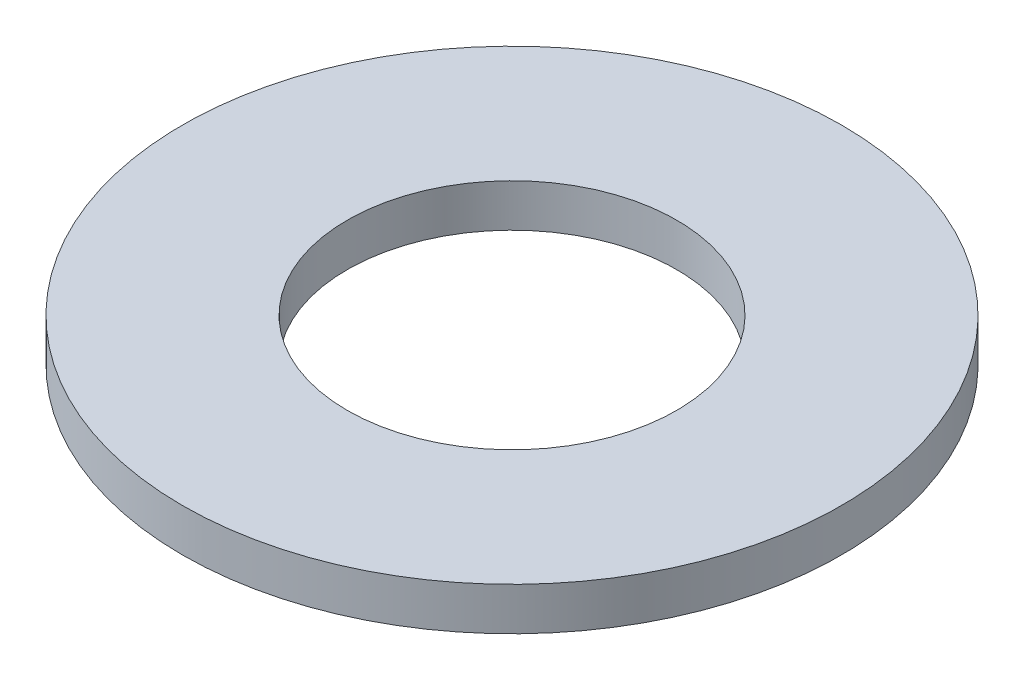
ISO-10303-21;
HEADER;
FILE_DESCRIPTION(('STEP AP214'),'2;1');
FILE_NAME('part.step','',(''),(''),'','','');
FILE_SCHEMA(('AUTOMOTIVE_DESIGN { 1 0 10303 214 1 1 1 1 }'));
ENDSEC;
DATA;
#1=APPLICATION_CONTEXT('core data for automotive mechanical design processes');
#2=APPLICATION_PROTOCOL_DEFINITION('international standard','automotive_design',2000,#1);
#3=PRODUCT_CONTEXT('',#1,'mechanical');
#4=PRODUCT('Part','Part','',(#3));
#5=PRODUCT_RELATED_PRODUCT_CATEGORY('part','',(#4));
#6=PRODUCT_DEFINITION_FORMATION('','',#4);
#7=PRODUCT_DEFINITION_CONTEXT('part definition',#1,'design');
#8=PRODUCT_DEFINITION('design','',#6,#7);
#9=PRODUCT_DEFINITION_SHAPE('','',#8);
#10=(LENGTH_UNIT() NAMED_UNIT(*) SI_UNIT(.MILLI.,.METRE.));
#11=(NAMED_UNIT(*) PLANE_ANGLE_UNIT() SI_UNIT($,.RADIAN.));
#12=(NAMED_UNIT(*) SI_UNIT($,.STERADIAN.) SOLID_ANGLE_UNIT());
#13=UNCERTAINTY_MEASURE_WITH_UNIT(LENGTH_MEASURE(1.E-05),#10,'distance_accuracy_value','');
#14=(GEOMETRIC_REPRESENTATION_CONTEXT(3) GLOBAL_UNCERTAINTY_ASSIGNED_CONTEXT((#13)) GLOBAL_UNIT_ASSIGNED_CONTEXT((#10,
#11,#12)) REPRESENTATION_CONTEXT('',''));
#15=CARTESIAN_POINT('',(0.,0.,0.));
#16=DIRECTION('',(0.,0.,1.));
#17=DIRECTION('',(1.,0.,0.));
#18=AXIS2_PLACEMENT_3D('',#15,#16,#17);
#19=CARTESIAN_POINT('',(0.,1.651,0.));
#20=DIRECTION('',(0.,1.,0.));
#21=DIRECTION('',(0.,0.,1.));
#22=AXIS2_PLACEMENT_3D('',#19,#20,#21);
#23=PLANE('',#22);
#24=CARTESIAN_POINT('',(0.,1.651,0.));
#25=DIRECTION('',(0.,1.,0.));
#26=DIRECTION('',(0.,0.,1.));
#27=AXIS2_PLACEMENT_3D('',#24,#25,#26);
#28=CIRCLE('',#27,12.7);
#29=CARTESIAN_POINT('',(0.,1.651,12.7));
#30=VERTEX_POINT('',#29);
#31=EDGE_CURVE('E10',#30,#30,#28,.T.);
#32=ORIENTED_EDGE('',*,*,#31,.T.);
#33=EDGE_LOOP('',(#32));
#34=FACE_BOUND('',#33,.T.);
#35=CARTESIAN_POINT('',(0.,1.651,0.));
#36=DIRECTION('',(0.,1.,0.));
#37=DIRECTION('',(0.,0.,1.));
#38=AXIS2_PLACEMENT_3D('',#35,#36,#37);
#39=CIRCLE('',#38,6.35);
#40=CARTESIAN_POINT('',(0.,1.651,6.35));
#41=VERTEX_POINT('',#40);
#42=EDGE_CURVE('E50',#41,#41,#39,.T.);
#43=ORIENTED_EDGE('',*,*,#42,.F.);
#44=EDGE_LOOP('',(#43));
#45=FACE_BOUND('',#44,.T.);
#46=ADVANCED_FACE('F39',(#34,#45),#23,.T.);
#47=CARTESIAN_POINT('',(0.,0.,0.));
#48=DIRECTION('',(0.,1.,0.));
#49=DIRECTION('',(0.,0.,1.));
#50=AXIS2_PLACEMENT_3D('',#47,#48,#49);
#51=PLANE('',#50);
#52=CARTESIAN_POINT('',(0.,0.,0.));
#53=DIRECTION('',(0.,1.,0.));
#54=DIRECTION('',(0.,0.,1.));
#55=AXIS2_PLACEMENT_3D('',#52,#53,#54);
#56=CIRCLE('',#55,12.7);
#57=CARTESIAN_POINT('',(0.,0.,12.7));
#58=VERTEX_POINT('',#57);
#59=EDGE_CURVE('E43',#58,#58,#56,.T.);
#60=ORIENTED_EDGE('',*,*,#59,.F.);
#61=EDGE_LOOP('',(#60));
#62=FACE_BOUND('',#61,.T.);
#63=CARTESIAN_POINT('',(0.,0.,0.));
#64=DIRECTION('',(0.,1.,0.));
#65=DIRECTION('',(0.,0.,1.));
#66=AXIS2_PLACEMENT_3D('',#63,#64,#65);
#67=CIRCLE('',#66,6.35);
#68=CARTESIAN_POINT('',(0.,0.,6.35));
#69=VERTEX_POINT('',#68);
#70=EDGE_CURVE('E52',#69,#69,#67,.T.);
#71=ORIENTED_EDGE('',*,*,#70,.T.);
#72=EDGE_LOOP('',(#71));
#73=FACE_BOUND('',#72,.T.);
#74=ADVANCED_FACE('F62',(#62,#73),#51,.F.);
#75=CARTESIAN_POINT('',(0.,1.651,0.));
#76=DIRECTION('',(0.,-1.,0.));
#77=DIRECTION('',(0.,0.,-1.));
#78=AXIS2_PLACEMENT_3D('',#75,#76,#77);
#79=CYLINDRICAL_SURFACE('',#78,12.7);
#80=ORIENTED_EDGE('',*,*,#31,.F.);
#81=EDGE_LOOP('',(#80));
#82=FACE_BOUND('',#81,.T.);
#83=ORIENTED_EDGE('',*,*,#59,.T.);
#84=EDGE_LOOP('',(#83));
#85=FACE_BOUND('',#84,.T.);
#86=ADVANCED_FACE('F41',(#82,#85),#79,.T.);
#87=CARTESIAN_POINT('',(0.,1.651,0.));
#88=DIRECTION('',(0.,-1.,0.));
#89=DIRECTION('',(0.,0.,-1.));
#90=AXIS2_PLACEMENT_3D('',#87,#88,#89);
#91=CYLINDRICAL_SURFACE('',#90,6.35);
#92=ORIENTED_EDGE('',*,*,#42,.T.);
#93=EDGE_LOOP('',(#92));
#94=FACE_BOUND('',#93,.T.);
#95=ORIENTED_EDGE('',*,*,#70,.F.);
#96=EDGE_LOOP('',(#95));
#97=FACE_BOUND('',#96,.T.);
#98=ADVANCED_FACE('F58',(#94,#97),#91,.F.);
#99=CLOSED_SHELL('',(#46,#74,#86,#98));
#100=MANIFOLD_SOLID_BREP('B2',#99);
#101=ADVANCED_BREP_SHAPE_REPRESENTATION('',(#18,#100),#14);
#102=SHAPE_DEFINITION_REPRESENTATION(#9,#101);
ENDSEC;
END-ISO-10303-21;
